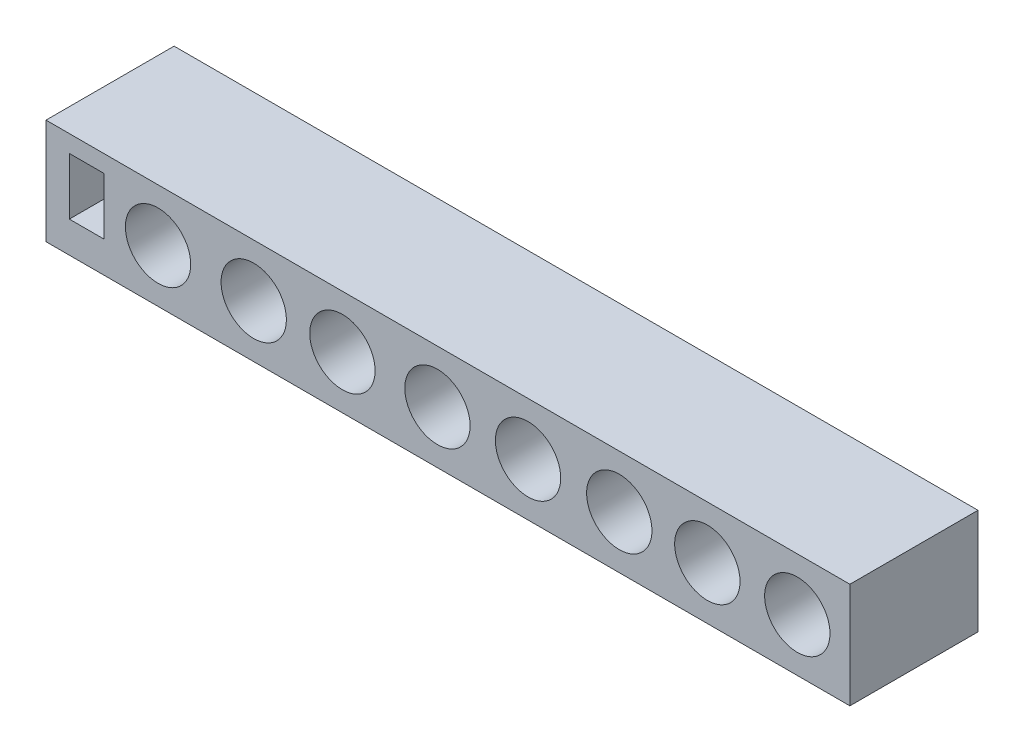
ISO-10303-21;
HEADER;
FILE_DESCRIPTION(('STEP AP214'),'2;1');
FILE_NAME('part.step','',(''),(''),'','','');
FILE_SCHEMA(('AUTOMOTIVE_DESIGN { 1 0 10303 214 1 1 1 1 }'));
ENDSEC;
DATA;
#1=APPLICATION_CONTEXT('core data for automotive mechanical design processes');
#2=APPLICATION_PROTOCOL_DEFINITION('international standard','automotive_design',2000,#1);
#3=PRODUCT_CONTEXT('',#1,'mechanical');
#4=PRODUCT('Part','Part','',(#3));
#5=PRODUCT_RELATED_PRODUCT_CATEGORY('part','',(#4));
#6=PRODUCT_DEFINITION_FORMATION('','',#4);
#7=PRODUCT_DEFINITION_CONTEXT('part definition',#1,'design');
#8=PRODUCT_DEFINITION('design','',#6,#7);
#9=PRODUCT_DEFINITION_SHAPE('','',#8);
#10=(LENGTH_UNIT() NAMED_UNIT(*) SI_UNIT(.MILLI.,.METRE.));
#11=(NAMED_UNIT(*) PLANE_ANGLE_UNIT() SI_UNIT($,.RADIAN.));
#12=(NAMED_UNIT(*) SI_UNIT($,.STERADIAN.) SOLID_ANGLE_UNIT());
#13=UNCERTAINTY_MEASURE_WITH_UNIT(LENGTH_MEASURE(1.E-05),#10,'distance_accuracy_value','');
#14=(GEOMETRIC_REPRESENTATION_CONTEXT(3) GLOBAL_UNCERTAINTY_ASSIGNED_CONTEXT((#13)) GLOBAL_UNIT_ASSIGNED_CONTEXT((#10,
#11,#12)) REPRESENTATION_CONTEXT('',''));
#15=CARTESIAN_POINT('',(0.,0.,0.));
#16=DIRECTION('',(0.,0.,1.));
#17=DIRECTION('',(1.,0.,0.));
#18=AXIS2_PLACEMENT_3D('',#15,#16,#17);
#19=CARTESIAN_POINT('',(0.,0.,10.));
#20=DIRECTION('',(0.,0.,-1.));
#21=DIRECTION('',(-1.,0.,0.));
#22=AXIS2_PLACEMENT_3D('',#19,#20,#21);
#23=PLANE('',#22);
#24=DIRECTION('',(0.,1.,0.));
#25=VECTOR('',#24,1.);
#26=CARTESIAN_POINT('',(0.,0.,10.));
#27=LINE('',#26,#25);
#28=CARTESIAN_POINT('',(0.,0.,10.));
#29=VERTEX_POINT('',#28);
#30=CARTESIAN_POINT('',(0.,8.22292183537418,10.));
#31=VERTEX_POINT('',#30);
#32=EDGE_CURVE('E139',#29,#31,#27,.T.);
#33=ORIENTED_EDGE('',*,*,#32,.F.);
#34=DIRECTION('',(1.,0.,0.));
#35=VECTOR('',#34,1.);
#36=CARTESIAN_POINT('',(0.,0.,10.));
#37=LINE('',#36,#35);
#38=CARTESIAN_POINT('',(62.7555434024689,0.,10.));
#39=VERTEX_POINT('',#38);
#40=EDGE_CURVE('E148',#29,#39,#37,.T.);
#41=ORIENTED_EDGE('',*,*,#40,.T.);
#42=DIRECTION('',(0.,1.,0.));
#43=VECTOR('',#42,1.);
#44=CARTESIAN_POINT('',(62.7555434024689,0.,10.));
#45=LINE('',#44,#43);
#46=CARTESIAN_POINT('',(62.7555434024689,8.22292183537418,10.));
#47=VERTEX_POINT('',#46);
#48=EDGE_CURVE('E146',#39,#47,#45,.T.);
#49=ORIENTED_EDGE('',*,*,#48,.T.);
#50=DIRECTION('',(1.,0.,0.));
#51=VECTOR('',#50,1.);
#52=CARTESIAN_POINT('',(0.,8.22292183537418,10.));
#53=LINE('',#52,#51);
#54=EDGE_CURVE('E142',#31,#47,#53,.T.);
#55=ORIENTED_EDGE('',*,*,#54,.F.);
#56=EDGE_LOOP('',(#33,#41,#49,#55));
#57=FACE_BOUND('',#56,.T.);
#58=DIRECTION('',(0.,-1.,0.));
#59=VECTOR('',#58,1.);
#60=CARTESIAN_POINT('',(1.82224015524807,0.,10.));
#61=LINE('',#60,#59);
#62=CARTESIAN_POINT('',(1.82224015524807,6.8811565198335,10.));
#63=VERTEX_POINT('',#62);
#64=CARTESIAN_POINT('',(1.82224015524807,2.44166175790809,10.));
#65=VERTEX_POINT('',#64);
#66=EDGE_CURVE('E101',#63,#65,#61,.T.);
#67=ORIENTED_EDGE('',*,*,#66,.F.);
#68=DIRECTION('',(-1.,0.,0.));
#69=VECTOR('',#68,1.);
#70=CARTESIAN_POINT('',(0.,6.8811565198335,10.));
#71=LINE('',#70,#69);
#72=CARTESIAN_POINT('',(4.51165222285604,6.8811565198335,10.));
#73=VERTEX_POINT('',#72);
#74=EDGE_CURVE('E123',#73,#63,#71,.T.);
#75=ORIENTED_EDGE('',*,*,#74,.F.);
#76=DIRECTION('',(0.,-1.,0.));
#77=VECTOR('',#76,1.);
#78=CARTESIAN_POINT('',(4.51165222285606,0.,10.));
#79=LINE('',#78,#77);
#80=CARTESIAN_POINT('',(4.51165222285605,2.44166175790809,10.));
#81=VERTEX_POINT('',#80);
#82=EDGE_CURVE('E53',#73,#81,#79,.T.);
#83=ORIENTED_EDGE('',*,*,#82,.T.);
#84=DIRECTION('',(-1.,0.,0.));
#85=VECTOR('',#84,1.);
#86=CARTESIAN_POINT('',(0.,2.44166175790809,10.));
#87=LINE('',#86,#85);
#88=EDGE_CURVE('E110',#81,#65,#87,.T.);
#89=ORIENTED_EDGE('',*,*,#88,.T.);
#90=EDGE_LOOP('',(#67,#75,#83,#89));
#91=FACE_BOUND('',#90,.T.);
#92=CARTESIAN_POINT('',(8.74647916061408,4.11146091768709,10.));
#93=DIRECTION('',(0.,0.,1.));
#94=DIRECTION('',(1.,0.,0.));
#95=AXIS2_PLACEMENT_3D('',#92,#93,#94);
#96=CIRCLE('',#95,2.55);
#97=CARTESIAN_POINT('',(11.2964791606141,4.11146091768709,10.));
#98=VERTEX_POINT('',#97);
#99=EDGE_CURVE('E118',#98,#98,#96,.T.);
#100=ORIENTED_EDGE('',*,*,#99,.F.);
#101=EDGE_LOOP('',(#100));
#102=FACE_BOUND('',#101,.T.);
#103=CARTESIAN_POINT('',(16.2147655164017,4.11146091768709,10.));
#104=DIRECTION('',(0.,0.,1.));
#105=DIRECTION('',(1.,0.,0.));
#106=AXIS2_PLACEMENT_3D('',#103,#104,#105);
#107=CIRCLE('',#106,2.55);
#108=CARTESIAN_POINT('',(18.7647655164017,4.11146091768709,10.));
#109=VERTEX_POINT('',#108);
#110=EDGE_CURVE('E203',#109,#109,#107,.T.);
#111=ORIENTED_EDGE('',*,*,#110,.F.);
#112=EDGE_LOOP('',(#111));
#113=FACE_BOUND('',#112,.T.);
#114=CARTESIAN_POINT('',(23.1390045217677,4.11146091768709,10.));
#115=DIRECTION('',(0.,0.,1.));
#116=DIRECTION('',(1.,0.,0.));
#117=AXIS2_PLACEMENT_3D('',#114,#115,#116);
#118=CIRCLE('',#117,2.55);
#119=CARTESIAN_POINT('',(25.6890045217677,4.11146091768709,10.));
#120=VERTEX_POINT('',#119);
#121=EDGE_CURVE('E205',#120,#120,#118,.T.);
#122=ORIENTED_EDGE('',*,*,#121,.F.);
#123=EDGE_LOOP('',(#122));
#124=FACE_BOUND('',#123,.T.);
#125=CARTESIAN_POINT('',(30.557832027517,4.11146091768709,10.));
#126=DIRECTION('',(0.,0.,1.));
#127=DIRECTION('',(1.,0.,0.));
#128=AXIS2_PLACEMENT_3D('',#125,#126,#127);
#129=CIRCLE('',#128,2.55);
#130=CARTESIAN_POINT('',(33.107832027517,4.11146091768709,10.));
#131=VERTEX_POINT('',#130);
#132=EDGE_CURVE('E210',#131,#131,#129,.T.);
#133=ORIENTED_EDGE('',*,*,#132,.F.);
#134=EDGE_LOOP('',(#133));
#135=FACE_BOUND('',#134,.T.);
#136=CARTESIAN_POINT('',(37.630447582998,4.11146091768709,10.));
#137=DIRECTION('',(0.,0.,1.));
#138=DIRECTION('',(1.,0.,0.));
#139=AXIS2_PLACEMENT_3D('',#136,#137,#138);
#140=CIRCLE('',#139,2.55);
#141=CARTESIAN_POINT('',(40.180447582998,4.11146091768709,10.));
#142=VERTEX_POINT('',#141);
#143=EDGE_CURVE('E213',#142,#142,#140,.T.);
#144=ORIENTED_EDGE('',*,*,#143,.F.);
#145=EDGE_LOOP('',(#144));
#146=FACE_BOUND('',#145,.T.);
#147=CARTESIAN_POINT('',(44.7525219885173,4.11146091768709,10.));
#148=DIRECTION('',(0.,0.,1.));
#149=DIRECTION('',(1.,0.,0.));
#150=AXIS2_PLACEMENT_3D('',#147,#148,#149);
#151=CIRCLE('',#150,2.55);
#152=CARTESIAN_POINT('',(47.3025219885173,4.11146091768709,10.));
#153=VERTEX_POINT('',#152);
#154=EDGE_CURVE('E216',#153,#153,#151,.T.);
#155=ORIENTED_EDGE('',*,*,#154,.F.);
#156=EDGE_LOOP('',(#155));
#157=FACE_BOUND('',#156,.T.);
#158=CARTESIAN_POINT('',(51.627302143845,4.1114609176871,10.));
#159=DIRECTION('',(0.,0.,1.));
#160=DIRECTION('',(1.,0.,0.));
#161=AXIS2_PLACEMENT_3D('',#158,#159,#160);
#162=CIRCLE('',#161,2.55);
#163=CARTESIAN_POINT('',(54.177302143845,4.1114609176871,10.));
#164=VERTEX_POINT('',#163);
#165=EDGE_CURVE('E219',#164,#164,#162,.T.);
#166=ORIENTED_EDGE('',*,*,#165,.F.);
#167=EDGE_LOOP('',(#166));
#168=FACE_BOUND('',#167,.T.);
#169=CARTESIAN_POINT('',(58.6504588492877,4.1114609176871,10.));
#170=DIRECTION('',(0.,0.,1.));
#171=DIRECTION('',(1.,0.,0.));
#172=AXIS2_PLACEMENT_3D('',#169,#170,#171);
#173=CIRCLE('',#172,2.55);
#174=CARTESIAN_POINT('',(61.2004588492877,4.1114609176871,10.));
#175=VERTEX_POINT('',#174);
#176=EDGE_CURVE('E155',#175,#175,#173,.T.);
#177=ORIENTED_EDGE('',*,*,#176,.F.);
#178=EDGE_LOOP('',(#177));
#179=FACE_BOUND('',#178,.T.);
#180=ADVANCED_FACE('F36',(#57,#91,#102,#113,#124,#135,#146,#157,#168,#179),#23,.F.);
#181=CARTESIAN_POINT('',(0.,0.,0.));
#182=DIRECTION('',(0.,0.,-1.));
#183=DIRECTION('',(-1.,0.,0.));
#184=AXIS2_PLACEMENT_3D('',#181,#182,#183);
#185=PLANE('',#184);
#186=CARTESIAN_POINT('',(58.6504588492877,4.1114609176871,0.));
#187=DIRECTION('',(0.,0.,1.));
#188=DIRECTION('',(1.,0.,0.));
#189=AXIS2_PLACEMENT_3D('',#186,#187,#188);
#190=CIRCLE('',#189,2.90000000000001);
#191=CARTESIAN_POINT('',(61.5504588492877,4.1114609176871,0.));
#192=VERTEX_POINT('',#191);
#193=EDGE_CURVE('E266',#192,#192,#190,.T.);
#194=ORIENTED_EDGE('',*,*,#193,.T.);
#195=EDGE_LOOP('',(#194));
#196=FACE_BOUND('',#195,.T.);
#197=CARTESIAN_POINT('',(51.627302143845,4.1114609176871,0.));
#198=DIRECTION('',(0.,0.,1.));
#199=DIRECTION('',(1.,0.,0.));
#200=AXIS2_PLACEMENT_3D('',#197,#198,#199);
#201=CIRCLE('',#200,2.875);
#202=CARTESIAN_POINT('',(54.502302143845,4.1114609176871,0.));
#203=VERTEX_POINT('',#202);
#204=EDGE_CURVE('E263',#203,#203,#201,.T.);
#205=ORIENTED_EDGE('',*,*,#204,.T.);
#206=EDGE_LOOP('',(#205));
#207=FACE_BOUND('',#206,.T.);
#208=CARTESIAN_POINT('',(44.7525219885173,4.11146091768709,0.));
#209=DIRECTION('',(0.,0.,1.));
#210=DIRECTION('',(1.,0.,0.));
#211=AXIS2_PLACEMENT_3D('',#208,#209,#210);
#212=CIRCLE('',#211,2.85);
#213=CARTESIAN_POINT('',(47.6025219885173,4.11146091768709,0.));
#214=VERTEX_POINT('',#213);
#215=EDGE_CURVE('E257',#214,#214,#212,.T.);
#216=ORIENTED_EDGE('',*,*,#215,.T.);
#217=EDGE_LOOP('',(#216));
#218=FACE_BOUND('',#217,.T.);
#219=CARTESIAN_POINT('',(37.630447582998,4.11146091768709,0.));
#220=DIRECTION('',(0.,0.,1.));
#221=DIRECTION('',(1.,0.,0.));
#222=AXIS2_PLACEMENT_3D('',#219,#220,#221);
#223=CIRCLE('',#222,2.825);
#224=CARTESIAN_POINT('',(40.455447582998,4.11146091768709,0.));
#225=VERTEX_POINT('',#224);
#226=EDGE_CURVE('E251',#225,#225,#223,.T.);
#227=ORIENTED_EDGE('',*,*,#226,.T.);
#228=EDGE_LOOP('',(#227));
#229=FACE_BOUND('',#228,.T.);
#230=CARTESIAN_POINT('',(30.557832027517,4.11146091768709,0.));
#231=DIRECTION('',(0.,0.,1.));
#232=DIRECTION('',(1.,0.,0.));
#233=AXIS2_PLACEMENT_3D('',#230,#231,#232);
#234=CIRCLE('',#233,2.725);
#235=CARTESIAN_POINT('',(33.282832027517,4.11146091768709,0.));
#236=VERTEX_POINT('',#235);
#237=EDGE_CURVE('E245',#236,#236,#234,.T.);
#238=ORIENTED_EDGE('',*,*,#237,.T.);
#239=EDGE_LOOP('',(#238));
#240=FACE_BOUND('',#239,.T.);
#241=CARTESIAN_POINT('',(23.1390045217677,4.11146091768709,0.));
#242=DIRECTION('',(0.,0.,1.));
#243=DIRECTION('',(1.,0.,0.));
#244=AXIS2_PLACEMENT_3D('',#241,#242,#243);
#245=CIRCLE('',#244,2.75);
#246=CARTESIAN_POINT('',(25.8890045217677,4.11146091768709,0.));
#247=VERTEX_POINT('',#246);
#248=EDGE_CURVE('E239',#247,#247,#245,.T.);
#249=ORIENTED_EDGE('',*,*,#248,.T.);
#250=EDGE_LOOP('',(#249));
#251=FACE_BOUND('',#250,.T.);
#252=CARTESIAN_POINT('',(16.2147655164017,4.11146091768709,0.));
#253=DIRECTION('',(0.,0.,1.));
#254=DIRECTION('',(1.,0.,0.));
#255=AXIS2_PLACEMENT_3D('',#252,#253,#254);
#256=CIRCLE('',#255,2.775);
#257=CARTESIAN_POINT('',(18.9897655164017,4.11146091768709,0.));
#258=VERTEX_POINT('',#257);
#259=EDGE_CURVE('E233',#258,#258,#256,.T.);
#260=ORIENTED_EDGE('',*,*,#259,.T.);
#261=EDGE_LOOP('',(#260));
#262=FACE_BOUND('',#261,.T.);
#263=CARTESIAN_POINT('',(8.74647916061408,4.11146091768709,0.));
#264=DIRECTION('',(0.,0.,1.));
#265=DIRECTION('',(1.,0.,0.));
#266=AXIS2_PLACEMENT_3D('',#263,#264,#265);
#267=CIRCLE('',#266,2.8);
#268=CARTESIAN_POINT('',(11.5464791606141,4.11146091768709,0.));
#269=VERTEX_POINT('',#268);
#270=EDGE_CURVE('E227',#269,#269,#267,.T.);
#271=ORIENTED_EDGE('',*,*,#270,.T.);
#272=EDGE_LOOP('',(#271));
#273=FACE_BOUND('',#272,.T.);
#274=DIRECTION('',(0.,1.,0.));
#275=VECTOR('',#274,1.);
#276=CARTESIAN_POINT('',(0.,0.,0.));
#277=LINE('',#276,#275);
#278=CARTESIAN_POINT('',(0.,0.,0.));
#279=VERTEX_POINT('',#278);
#280=CARTESIAN_POINT('',(0.,8.22292183537418,0.));
#281=VERTEX_POINT('',#280);
#282=EDGE_CURVE('E151',#279,#281,#277,.T.);
#283=ORIENTED_EDGE('',*,*,#282,.T.);
#284=DIRECTION('',(1.,0.,0.));
#285=VECTOR('',#284,1.);
#286=CARTESIAN_POINT('',(0.,8.22292183537418,0.));
#287=LINE('',#286,#285);
#288=CARTESIAN_POINT('',(62.7555434024689,8.22292183537418,0.));
#289=VERTEX_POINT('',#288);
#290=EDGE_CURVE('E154',#281,#289,#287,.T.);
#291=ORIENTED_EDGE('',*,*,#290,.T.);
#292=DIRECTION('',(0.,1.,0.));
#293=VECTOR('',#292,1.);
#294=CARTESIAN_POINT('',(62.7555434024689,0.,0.));
#295=LINE('',#294,#293);
#296=CARTESIAN_POINT('',(62.7555434024689,0.,0.));
#297=VERTEX_POINT('',#296);
#298=EDGE_CURVE('E158',#297,#289,#295,.T.);
#299=ORIENTED_EDGE('',*,*,#298,.F.);
#300=DIRECTION('',(1.,0.,0.));
#301=VECTOR('',#300,1.);
#302=CARTESIAN_POINT('',(0.,0.,0.));
#303=LINE('',#302,#301);
#304=EDGE_CURVE('E143',#279,#297,#303,.T.);
#305=ORIENTED_EDGE('',*,*,#304,.F.);
#306=EDGE_LOOP('',(#283,#291,#299,#305));
#307=FACE_BOUND('',#306,.T.);
#308=DIRECTION('',(-1.,0.,0.));
#309=VECTOR('',#308,1.);
#310=CARTESIAN_POINT('',(0.,6.8811565198335,0.));
#311=LINE('',#310,#309);
#312=CARTESIAN_POINT('',(4.51165222285604,6.8811565198335,0.));
#313=VERTEX_POINT('',#312);
#314=CARTESIAN_POINT('',(1.82224015524807,6.8811565198335,0.));
#315=VERTEX_POINT('',#314);
#316=EDGE_CURVE('E111',#313,#315,#311,.T.);
#317=ORIENTED_EDGE('',*,*,#316,.T.);
#318=DIRECTION('',(0.,-1.,0.));
#319=VECTOR('',#318,1.);
#320=CARTESIAN_POINT('',(1.82224015524807,0.,0.));
#321=LINE('',#320,#319);
#322=CARTESIAN_POINT('',(1.82224015524807,2.44166175790809,0.));
#323=VERTEX_POINT('',#322);
#324=EDGE_CURVE('E61',#315,#323,#321,.T.);
#325=ORIENTED_EDGE('',*,*,#324,.T.);
#326=DIRECTION('',(-1.,0.,0.));
#327=VECTOR('',#326,1.);
#328=CARTESIAN_POINT('',(0.,2.44166175790809,0.));
#329=LINE('',#328,#327);
#330=CARTESIAN_POINT('',(4.51165222285605,2.44166175790809,0.));
#331=VERTEX_POINT('',#330);
#332=EDGE_CURVE('E117',#331,#323,#329,.T.);
#333=ORIENTED_EDGE('',*,*,#332,.F.);
#334=DIRECTION('',(0.,-1.,0.));
#335=VECTOR('',#334,1.);
#336=CARTESIAN_POINT('',(4.51165222285606,0.,0.));
#337=LINE('',#336,#335);
#338=EDGE_CURVE('E130',#313,#331,#337,.T.);
#339=ORIENTED_EDGE('',*,*,#338,.F.);
#340=EDGE_LOOP('',(#317,#325,#333,#339));
#341=FACE_BOUND('',#340,.T.);
#342=ADVANCED_FACE('F290',(#196,#207,#218,#229,#240,#251,#262,#273,#307,#341),#185,.T.);
#343=CARTESIAN_POINT('',(0.,0.,10.));
#344=DIRECTION('',(-1.,0.,0.));
#345=DIRECTION('',(0.,0.,1.));
#346=AXIS2_PLACEMENT_3D('',#343,#344,#345);
#347=PLANE('',#346);
#348=ORIENTED_EDGE('',*,*,#282,.F.);
#349=DIRECTION('',(0.,0.,-1.));
#350=VECTOR('',#349,1.);
#351=CARTESIAN_POINT('',(0.,0.,10.));
#352=LINE('',#351,#350);
#353=EDGE_CURVE('E11',#29,#279,#352,.T.);
#354=ORIENTED_EDGE('',*,*,#353,.F.);
#355=ORIENTED_EDGE('',*,*,#32,.T.);
#356=DIRECTION('',(0.,0.,-1.));
#357=VECTOR('',#356,1.);
#358=CARTESIAN_POINT('',(0.,8.22292183537418,10.));
#359=LINE('',#358,#357);
#360=EDGE_CURVE('E150',#31,#281,#359,.T.);
#361=ORIENTED_EDGE('',*,*,#360,.T.);
#362=EDGE_LOOP('',(#348,#354,#355,#361));
#363=FACE_BOUND('',#362,.T.);
#364=ADVANCED_FACE('F38',(#363),#347,.T.);
#365=CARTESIAN_POINT('',(0.,0.,10.));
#366=DIRECTION('',(0.,1.,0.));
#367=DIRECTION('',(0.,0.,1.));
#368=AXIS2_PLACEMENT_3D('',#365,#366,#367);
#369=PLANE('',#368);
#370=ORIENTED_EDGE('',*,*,#304,.T.);
#371=DIRECTION('',(0.,0.,-1.));
#372=VECTOR('',#371,1.);
#373=CARTESIAN_POINT('',(62.7555434024689,0.,10.));
#374=LINE('',#373,#372);
#375=EDGE_CURVE('E45',#39,#297,#374,.T.);
#376=ORIENTED_EDGE('',*,*,#375,.F.);
#377=ORIENTED_EDGE('',*,*,#40,.F.);
#378=ORIENTED_EDGE('',*,*,#353,.T.);
#379=EDGE_LOOP('',(#370,#376,#377,#378));
#380=FACE_BOUND('',#379,.T.);
#381=ADVANCED_FACE('F302',(#380),#369,.F.);
#382=CARTESIAN_POINT('',(62.7555434024689,0.,10.));
#383=DIRECTION('',(-1.,0.,0.));
#384=DIRECTION('',(0.,0.,1.));
#385=AXIS2_PLACEMENT_3D('',#382,#383,#384);
#386=PLANE('',#385);
#387=ORIENTED_EDGE('',*,*,#298,.T.);
#388=DIRECTION('',(0.,0.,-1.));
#389=VECTOR('',#388,1.);
#390=CARTESIAN_POINT('',(62.7555434024689,8.22292183537418,10.));
#391=LINE('',#390,#389);
#392=EDGE_CURVE('E164',#47,#289,#391,.T.);
#393=ORIENTED_EDGE('',*,*,#392,.F.);
#394=ORIENTED_EDGE('',*,*,#48,.F.);
#395=ORIENTED_EDGE('',*,*,#375,.T.);
#396=EDGE_LOOP('',(#387,#393,#394,#395));
#397=FACE_BOUND('',#396,.T.);
#398=ADVANCED_FACE('F305',(#397),#386,.F.);
#399=CARTESIAN_POINT('',(0.,8.22292183537418,10.));
#400=DIRECTION('',(0.,1.,0.));
#401=DIRECTION('',(0.,0.,1.));
#402=AXIS2_PLACEMENT_3D('',#399,#400,#401);
#403=PLANE('',#402);
#404=ORIENTED_EDGE('',*,*,#290,.F.);
#405=ORIENTED_EDGE('',*,*,#360,.F.);
#406=ORIENTED_EDGE('',*,*,#54,.T.);
#407=ORIENTED_EDGE('',*,*,#392,.T.);
#408=EDGE_LOOP('',(#404,#405,#406,#407));
#409=FACE_BOUND('',#408,.T.);
#410=ADVANCED_FACE('F308',(#409),#403,.T.);
#411=CARTESIAN_POINT('',(1.82224015524807,0.,10.));
#412=DIRECTION('',(1.,0.,0.));
#413=DIRECTION('',(0.,1.,0.));
#414=AXIS2_PLACEMENT_3D('',#411,#412,#413);
#415=PLANE('',#414);
#416=ORIENTED_EDGE('',*,*,#324,.F.);
#417=DIRECTION('',(0.,0.,-1.));
#418=VECTOR('',#417,1.);
#419=CARTESIAN_POINT('',(1.82224015524807,6.8811565198335,10.));
#420=LINE('',#419,#418);
#421=EDGE_CURVE('E106',#63,#315,#420,.T.);
#422=ORIENTED_EDGE('',*,*,#421,.F.);
#423=ORIENTED_EDGE('',*,*,#66,.T.);
#424=DIRECTION('',(0.,0.,-1.));
#425=VECTOR('',#424,1.);
#426=CARTESIAN_POINT('',(1.82224015524807,2.44166175790809,10.));
#427=LINE('',#426,#425);
#428=EDGE_CURVE('E104',#65,#323,#427,.T.);
#429=ORIENTED_EDGE('',*,*,#428,.T.);
#430=EDGE_LOOP('',(#416,#422,#423,#429));
#431=FACE_BOUND('',#430,.T.);
#432=ADVANCED_FACE('F103',(#431),#415,.T.);
#433=CARTESIAN_POINT('',(0.,2.44166175790809,10.));
#434=DIRECTION('',(0.,-1.,0.));
#435=DIRECTION('',(1.,0.,0.));
#436=AXIS2_PLACEMENT_3D('',#433,#434,#435);
#437=PLANE('',#436);
#438=ORIENTED_EDGE('',*,*,#332,.T.);
#439=ORIENTED_EDGE('',*,*,#428,.F.);
#440=ORIENTED_EDGE('',*,*,#88,.F.);
#441=DIRECTION('',(0.,0.,-1.));
#442=VECTOR('',#441,1.);
#443=CARTESIAN_POINT('',(4.51165222285605,2.44166175790809,10.));
#444=LINE('',#443,#442);
#445=EDGE_CURVE('E119',#81,#331,#444,.T.);
#446=ORIENTED_EDGE('',*,*,#445,.T.);
#447=EDGE_LOOP('',(#438,#439,#440,#446));
#448=FACE_BOUND('',#447,.T.);
#449=ADVANCED_FACE('F115',(#448),#437,.F.);
#450=CARTESIAN_POINT('',(4.51165222285606,0.,10.));
#451=DIRECTION('',(1.,0.,0.));
#452=DIRECTION('',(0.,1.,0.));
#453=AXIS2_PLACEMENT_3D('',#450,#451,#452);
#454=PLANE('',#453);
#455=ORIENTED_EDGE('',*,*,#338,.T.);
#456=ORIENTED_EDGE('',*,*,#445,.F.);
#457=ORIENTED_EDGE('',*,*,#82,.F.);
#458=DIRECTION('',(0.,0.,-1.));
#459=VECTOR('',#458,1.);
#460=CARTESIAN_POINT('',(4.51165222285604,6.8811565198335,10.));
#461=LINE('',#460,#459);
#462=EDGE_CURVE('E136',#73,#313,#461,.T.);
#463=ORIENTED_EDGE('',*,*,#462,.T.);
#464=EDGE_LOOP('',(#455,#456,#457,#463));
#465=FACE_BOUND('',#464,.T.);
#466=ADVANCED_FACE('F364',(#465),#454,.F.);
#467=CARTESIAN_POINT('',(0.,6.8811565198335,10.));
#468=DIRECTION('',(0.,-1.,0.));
#469=DIRECTION('',(0.,0.,-1.));
#470=AXIS2_PLACEMENT_3D('',#467,#468,#469);
#471=PLANE('',#470);
#472=ORIENTED_EDGE('',*,*,#316,.F.);
#473=ORIENTED_EDGE('',*,*,#462,.F.);
#474=ORIENTED_EDGE('',*,*,#74,.T.);
#475=ORIENTED_EDGE('',*,*,#421,.T.);
#476=EDGE_LOOP('',(#472,#473,#474,#475));
#477=FACE_BOUND('',#476,.T.);
#478=ADVANCED_FACE('F199',(#477),#471,.T.);
#479=CARTESIAN_POINT('',(8.74647916061408,4.11146091768709,10.));
#480=DIRECTION('',(0.,0.,-1.));
#481=DIRECTION('',(-1.,0.,0.));
#482=AXIS2_PLACEMENT_3D('',#479,#480,#481);
#483=CYLINDRICAL_SURFACE('',#482,2.55);
#484=CARTESIAN_POINT('',(8.74647916061408,4.11146091768709,1.2));
#485=DIRECTION('',(0.,0.,1.));
#486=DIRECTION('',(1.,0.,0.));
#487=AXIS2_PLACEMENT_3D('',#484,#485,#486);
#488=CIRCLE('',#487,2.55);
#489=CARTESIAN_POINT('',(11.2964791606141,4.11146091768709,1.2));
#490=VERTEX_POINT('',#489);
#491=EDGE_CURVE('E40',#490,#490,#488,.T.);
#492=ORIENTED_EDGE('',*,*,#491,.F.);
#493=EDGE_LOOP('',(#492));
#494=FACE_BOUND('',#493,.T.);
#495=ORIENTED_EDGE('',*,*,#99,.T.);
#496=EDGE_LOOP('',(#495));
#497=FACE_BOUND('',#496,.T.);
#498=ADVANCED_FACE('F195',(#494,#497),#483,.F.);
#499=CARTESIAN_POINT('',(16.2147655164017,4.11146091768709,10.));
#500=DIRECTION('',(0.,0.,-1.));
#501=DIRECTION('',(-1.,0.,0.));
#502=AXIS2_PLACEMENT_3D('',#499,#500,#501);
#503=CYLINDRICAL_SURFACE('',#502,2.55);
#504=CARTESIAN_POINT('',(16.2147655164017,4.11146091768709,1.2));
#505=DIRECTION('',(0.,0.,1.));
#506=DIRECTION('',(1.,0.,0.));
#507=AXIS2_PLACEMENT_3D('',#504,#505,#506);
#508=CIRCLE('',#507,2.55);
#509=CARTESIAN_POINT('',(18.7647655164017,4.11146091768709,1.2));
#510=VERTEX_POINT('',#509);
#511=EDGE_CURVE('E185',#510,#510,#508,.T.);
#512=ORIENTED_EDGE('',*,*,#511,.F.);
#513=EDGE_LOOP('',(#512));
#514=FACE_BOUND('',#513,.T.);
#515=ORIENTED_EDGE('',*,*,#110,.T.);
#516=EDGE_LOOP('',(#515));
#517=FACE_BOUND('',#516,.T.);
#518=ADVANCED_FACE('F198',(#514,#517),#503,.F.);
#519=CARTESIAN_POINT('',(23.1390045217677,4.11146091768709,10.));
#520=DIRECTION('',(0.,0.,-1.));
#521=DIRECTION('',(-1.,0.,0.));
#522=AXIS2_PLACEMENT_3D('',#519,#520,#521);
#523=CYLINDRICAL_SURFACE('',#522,2.55);
#524=CARTESIAN_POINT('',(23.1390045217677,4.11146091768709,1.2));
#525=DIRECTION('',(0.,0.,1.));
#526=DIRECTION('',(1.,0.,0.));
#527=AXIS2_PLACEMENT_3D('',#524,#525,#526);
#528=CIRCLE('',#527,2.55);
#529=CARTESIAN_POINT('',(25.6890045217677,4.11146091768709,1.2));
#530=VERTEX_POINT('',#529);
#531=EDGE_CURVE('E183',#530,#530,#528,.T.);
#532=ORIENTED_EDGE('',*,*,#531,.F.);
#533=EDGE_LOOP('',(#532));
#534=FACE_BOUND('',#533,.T.);
#535=ORIENTED_EDGE('',*,*,#121,.T.);
#536=EDGE_LOOP('',(#535));
#537=FACE_BOUND('',#536,.T.);
#538=ADVANCED_FACE('F398',(#534,#537),#523,.F.);
#539=CARTESIAN_POINT('',(30.557832027517,4.11146091768709,10.));
#540=DIRECTION('',(0.,0.,-1.));
#541=DIRECTION('',(-1.,0.,0.));
#542=AXIS2_PLACEMENT_3D('',#539,#540,#541);
#543=CYLINDRICAL_SURFACE('',#542,2.55);
#544=CARTESIAN_POINT('',(30.557832027517,4.11146091768709,1.2));
#545=DIRECTION('',(0.,0.,1.));
#546=DIRECTION('',(1.,0.,0.));
#547=AXIS2_PLACEMENT_3D('',#544,#545,#546);
#548=CIRCLE('',#547,2.55);
#549=CARTESIAN_POINT('',(33.107832027517,4.11146091768709,1.2));
#550=VERTEX_POINT('',#549);
#551=EDGE_CURVE('E180',#550,#550,#548,.T.);
#552=ORIENTED_EDGE('',*,*,#551,.F.);
#553=EDGE_LOOP('',(#552));
#554=FACE_BOUND('',#553,.T.);
#555=ORIENTED_EDGE('',*,*,#132,.T.);
#556=EDGE_LOOP('',(#555));
#557=FACE_BOUND('',#556,.T.);
#558=ADVANCED_FACE('F408',(#554,#557),#543,.F.);
#559=CARTESIAN_POINT('',(37.630447582998,4.11146091768709,10.));
#560=DIRECTION('',(0.,0.,-1.));
#561=DIRECTION('',(-1.,0.,0.));
#562=AXIS2_PLACEMENT_3D('',#559,#560,#561);
#563=CYLINDRICAL_SURFACE('',#562,2.55);
#564=CARTESIAN_POINT('',(37.630447582998,4.11146091768709,1.2));
#565=DIRECTION('',(0.,0.,1.));
#566=DIRECTION('',(1.,0.,0.));
#567=AXIS2_PLACEMENT_3D('',#564,#565,#566);
#568=CIRCLE('',#567,2.55);
#569=CARTESIAN_POINT('',(40.180447582998,4.11146091768709,1.2));
#570=VERTEX_POINT('',#569);
#571=EDGE_CURVE('E177',#570,#570,#568,.T.);
#572=ORIENTED_EDGE('',*,*,#571,.F.);
#573=EDGE_LOOP('',(#572));
#574=FACE_BOUND('',#573,.T.);
#575=ORIENTED_EDGE('',*,*,#143,.T.);
#576=EDGE_LOOP('',(#575));
#577=FACE_BOUND('',#576,.T.);
#578=ADVANCED_FACE('F418',(#574,#577),#563,.F.);
#579=CARTESIAN_POINT('',(44.7525219885173,4.11146091768709,10.));
#580=DIRECTION('',(0.,0.,-1.));
#581=DIRECTION('',(-1.,0.,0.));
#582=AXIS2_PLACEMENT_3D('',#579,#580,#581);
#583=CYLINDRICAL_SURFACE('',#582,2.55);
#584=CARTESIAN_POINT('',(44.7525219885173,4.11146091768709,1.2));
#585=DIRECTION('',(0.,0.,1.));
#586=DIRECTION('',(1.,0.,0.));
#587=AXIS2_PLACEMENT_3D('',#584,#585,#586);
#588=CIRCLE('',#587,2.55);
#589=CARTESIAN_POINT('',(47.3025219885173,4.11146091768709,1.2));
#590=VERTEX_POINT('',#589);
#591=EDGE_CURVE('E174',#590,#590,#588,.T.);
#592=ORIENTED_EDGE('',*,*,#591,.F.);
#593=EDGE_LOOP('',(#592));
#594=FACE_BOUND('',#593,.T.);
#595=ORIENTED_EDGE('',*,*,#154,.T.);
#596=EDGE_LOOP('',(#595));
#597=FACE_BOUND('',#596,.T.);
#598=ADVANCED_FACE('F428',(#594,#597),#583,.F.);
#599=CARTESIAN_POINT('',(51.627302143845,4.1114609176871,10.));
#600=DIRECTION('',(0.,0.,-1.));
#601=DIRECTION('',(-1.,0.,0.));
#602=AXIS2_PLACEMENT_3D('',#599,#600,#601);
#603=CYLINDRICAL_SURFACE('',#602,2.55);
#604=CARTESIAN_POINT('',(51.627302143845,4.1114609176871,1.2));
#605=DIRECTION('',(0.,0.,1.));
#606=DIRECTION('',(1.,0.,0.));
#607=AXIS2_PLACEMENT_3D('',#604,#605,#606);
#608=CIRCLE('',#607,2.55);
#609=CARTESIAN_POINT('',(54.177302143845,4.1114609176871,1.2));
#610=VERTEX_POINT('',#609);
#611=EDGE_CURVE('E170',#610,#610,#608,.T.);
#612=ORIENTED_EDGE('',*,*,#611,.F.);
#613=EDGE_LOOP('',(#612));
#614=FACE_BOUND('',#613,.T.);
#615=ORIENTED_EDGE('',*,*,#165,.T.);
#616=EDGE_LOOP('',(#615));
#617=FACE_BOUND('',#616,.T.);
#618=ADVANCED_FACE('F438',(#614,#617),#603,.F.);
#619=CARTESIAN_POINT('',(58.6504588492877,4.1114609176871,10.));
#620=DIRECTION('',(0.,0.,-1.));
#621=DIRECTION('',(-1.,0.,0.));
#622=AXIS2_PLACEMENT_3D('',#619,#620,#621);
#623=CYLINDRICAL_SURFACE('',#622,2.55);
#624=CARTESIAN_POINT('',(58.6504588492877,4.1114609176871,1.2));
#625=DIRECTION('',(0.,0.,1.));
#626=DIRECTION('',(1.,0.,0.));
#627=AXIS2_PLACEMENT_3D('',#624,#625,#626);
#628=CIRCLE('',#627,2.55);
#629=CARTESIAN_POINT('',(61.2004588492877,4.1114609176871,1.2));
#630=VERTEX_POINT('',#629);
#631=EDGE_CURVE('E167',#630,#630,#628,.T.);
#632=ORIENTED_EDGE('',*,*,#631,.F.);
#633=EDGE_LOOP('',(#632));
#634=FACE_BOUND('',#633,.T.);
#635=ORIENTED_EDGE('',*,*,#176,.T.);
#636=EDGE_LOOP('',(#635));
#637=FACE_BOUND('',#636,.T.);
#638=ADVANCED_FACE('F287',(#634,#637),#623,.F.);
#639=CARTESIAN_POINT('',(58.6504588492877,4.1114609176871,1.2));
#640=DIRECTION('',(0.,0.,-1.));
#641=DIRECTION('',(-1.,0.,0.));
#642=AXIS2_PLACEMENT_3D('',#639,#640,#641);
#643=CYLINDRICAL_SURFACE('',#642,2.90000000000001);
#644=CARTESIAN_POINT('',(58.6504588492877,4.1114609176871,1.2));
#645=DIRECTION('',(0.,0.,1.));
#646=DIRECTION('',(1.,0.,0.));
#647=AXIS2_PLACEMENT_3D('',#644,#645,#646);
#648=CIRCLE('',#647,2.90000000000001);
#649=CARTESIAN_POINT('',(61.5504588492877,4.1114609176871,1.2));
#650=VERTEX_POINT('',#649);
#651=EDGE_CURVE('E171',#650,#650,#648,.T.);
#652=ORIENTED_EDGE('',*,*,#651,.T.);
#653=EDGE_LOOP('',(#652));
#654=FACE_BOUND('',#653,.T.);
#655=ORIENTED_EDGE('',*,*,#193,.F.);
#656=EDGE_LOOP('',(#655));
#657=FACE_BOUND('',#656,.T.);
#658=ADVANCED_FACE('F272',(#654,#657),#643,.F.);
#659=CARTESIAN_POINT('',(58.6504588492877,4.1114609176871,1.2));
#660=DIRECTION('',(0.,0.,1.));
#661=DIRECTION('',(1.,0.,0.));
#662=AXIS2_PLACEMENT_3D('',#659,#660,#661);
#663=PLANE('',#662);
#664=ORIENTED_EDGE('',*,*,#631,.T.);
#665=EDGE_LOOP('',(#664));
#666=FACE_BOUND('',#665,.T.);
#667=ORIENTED_EDGE('',*,*,#651,.F.);
#668=EDGE_LOOP('',(#667));
#669=FACE_BOUND('',#668,.T.);
#670=ADVANCED_FACE('F275',(#666,#669),#663,.F.);
#671=CARTESIAN_POINT('',(51.627302143845,4.1114609176871,1.2));
#672=DIRECTION('',(0.,0.,-1.));
#673=DIRECTION('',(-1.,0.,0.));
#674=AXIS2_PLACEMENT_3D('',#671,#672,#673);
#675=CYLINDRICAL_SURFACE('',#674,2.875);
#676=CARTESIAN_POINT('',(51.627302143845,4.1114609176871,1.2));
#677=DIRECTION('',(0.,0.,1.));
#678=DIRECTION('',(1.,0.,0.));
#679=AXIS2_PLACEMENT_3D('',#676,#677,#678);
#680=CIRCLE('',#679,2.875);
#681=CARTESIAN_POINT('',(54.502302143845,4.1114609176871,1.2));
#682=VERTEX_POINT('',#681);
#683=EDGE_CURVE('E260',#682,#682,#680,.T.);
#684=ORIENTED_EDGE('',*,*,#683,.T.);
#685=EDGE_LOOP('',(#684));
#686=FACE_BOUND('',#685,.T.);
#687=ORIENTED_EDGE('',*,*,#204,.F.);
#688=EDGE_LOOP('',(#687));
#689=FACE_BOUND('',#688,.T.);
#690=ADVANCED_FACE('F277',(#686,#689),#675,.F.);
#691=CARTESIAN_POINT('',(51.627302143845,4.1114609176871,1.2));
#692=DIRECTION('',(0.,0.,1.));
#693=DIRECTION('',(1.,0.,0.));
#694=AXIS2_PLACEMENT_3D('',#691,#692,#693);
#695=PLANE('',#694);
#696=ORIENTED_EDGE('',*,*,#611,.T.);
#697=EDGE_LOOP('',(#696));
#698=FACE_BOUND('',#697,.T.);
#699=ORIENTED_EDGE('',*,*,#683,.F.);
#700=EDGE_LOOP('',(#699));
#701=FACE_BOUND('',#700,.T.);
#702=ADVANCED_FACE('F284',(#698,#701),#695,.F.);
#703=CARTESIAN_POINT('',(44.7525219885173,4.11146091768709,1.2));
#704=DIRECTION('',(0.,0.,-1.));
#705=DIRECTION('',(-1.,0.,0.));
#706=AXIS2_PLACEMENT_3D('',#703,#704,#705);
#707=CYLINDRICAL_SURFACE('',#706,2.85);
#708=CARTESIAN_POINT('',(44.7525219885173,4.11146091768709,1.2));
#709=DIRECTION('',(0.,0.,1.));
#710=DIRECTION('',(1.,0.,0.));
#711=AXIS2_PLACEMENT_3D('',#708,#709,#710);
#712=CIRCLE('',#711,2.85);
#713=CARTESIAN_POINT('',(47.6025219885173,4.11146091768709,1.2));
#714=VERTEX_POINT('',#713);
#715=EDGE_CURVE('E254',#714,#714,#712,.T.);
#716=ORIENTED_EDGE('',*,*,#715,.T.);
#717=EDGE_LOOP('',(#716));
#718=FACE_BOUND('',#717,.T.);
#719=ORIENTED_EDGE('',*,*,#215,.F.);
#720=EDGE_LOOP('',(#719));
#721=FACE_BOUND('',#720,.T.);
#722=ADVANCED_FACE('F482',(#718,#721),#707,.F.);
#723=CARTESIAN_POINT('',(44.7525219885173,4.11146091768709,1.2));
#724=DIRECTION('',(0.,0.,1.));
#725=DIRECTION('',(1.,0.,0.));
#726=AXIS2_PLACEMENT_3D('',#723,#724,#725);
#727=PLANE('',#726);
#728=ORIENTED_EDGE('',*,*,#591,.T.);
#729=EDGE_LOOP('',(#728));
#730=FACE_BOUND('',#729,.T.);
#731=ORIENTED_EDGE('',*,*,#715,.F.);
#732=EDGE_LOOP('',(#731));
#733=FACE_BOUND('',#732,.T.);
#734=ADVANCED_FACE('F492',(#730,#733),#727,.F.);
#735=CARTESIAN_POINT('',(37.630447582998,4.11146091768709,1.2));
#736=DIRECTION('',(0.,0.,-1.));
#737=DIRECTION('',(-1.,0.,0.));
#738=AXIS2_PLACEMENT_3D('',#735,#736,#737);
#739=CYLINDRICAL_SURFACE('',#738,2.825);
#740=CARTESIAN_POINT('',(37.630447582998,4.11146091768709,1.2));
#741=DIRECTION('',(0.,0.,1.));
#742=DIRECTION('',(1.,0.,0.));
#743=AXIS2_PLACEMENT_3D('',#740,#741,#742);
#744=CIRCLE('',#743,2.825);
#745=CARTESIAN_POINT('',(40.455447582998,4.11146091768709,1.2));
#746=VERTEX_POINT('',#745);
#747=EDGE_CURVE('E248',#746,#746,#744,.T.);
#748=ORIENTED_EDGE('',*,*,#747,.T.);
#749=EDGE_LOOP('',(#748));
#750=FACE_BOUND('',#749,.T.);
#751=ORIENTED_EDGE('',*,*,#226,.F.);
#752=EDGE_LOOP('',(#751));
#753=FACE_BOUND('',#752,.T.);
#754=ADVANCED_FACE('F502',(#750,#753),#739,.F.);
#755=CARTESIAN_POINT('',(37.630447582998,4.11146091768709,1.2));
#756=DIRECTION('',(0.,0.,1.));
#757=DIRECTION('',(1.,0.,0.));
#758=AXIS2_PLACEMENT_3D('',#755,#756,#757);
#759=PLANE('',#758);
#760=ORIENTED_EDGE('',*,*,#571,.T.);
#761=EDGE_LOOP('',(#760));
#762=FACE_BOUND('',#761,.T.);
#763=ORIENTED_EDGE('',*,*,#747,.F.);
#764=EDGE_LOOP('',(#763));
#765=FACE_BOUND('',#764,.T.);
#766=ADVANCED_FACE('F512',(#762,#765),#759,.F.);
#767=CARTESIAN_POINT('',(30.557832027517,4.11146091768709,1.2));
#768=DIRECTION('',(0.,0.,-1.));
#769=DIRECTION('',(-1.,0.,0.));
#770=AXIS2_PLACEMENT_3D('',#767,#768,#769);
#771=CYLINDRICAL_SURFACE('',#770,2.725);
#772=CARTESIAN_POINT('',(30.557832027517,4.11146091768709,1.2));
#773=DIRECTION('',(0.,0.,1.));
#774=DIRECTION('',(1.,0.,0.));
#775=AXIS2_PLACEMENT_3D('',#772,#773,#774);
#776=CIRCLE('',#775,2.725);
#777=CARTESIAN_POINT('',(33.282832027517,4.11146091768709,1.2));
#778=VERTEX_POINT('',#777);
#779=EDGE_CURVE('E242',#778,#778,#776,.T.);
#780=ORIENTED_EDGE('',*,*,#779,.T.);
#781=EDGE_LOOP('',(#780));
#782=FACE_BOUND('',#781,.T.);
#783=ORIENTED_EDGE('',*,*,#237,.F.);
#784=EDGE_LOOP('',(#783));
#785=FACE_BOUND('',#784,.T.);
#786=ADVANCED_FACE('F522',(#782,#785),#771,.F.);
#787=CARTESIAN_POINT('',(30.557832027517,4.11146091768709,1.2));
#788=DIRECTION('',(0.,0.,1.));
#789=DIRECTION('',(1.,0.,0.));
#790=AXIS2_PLACEMENT_3D('',#787,#788,#789);
#791=PLANE('',#790);
#792=ORIENTED_EDGE('',*,*,#551,.T.);
#793=EDGE_LOOP('',(#792));
#794=FACE_BOUND('',#793,.T.);
#795=ORIENTED_EDGE('',*,*,#779,.F.);
#796=EDGE_LOOP('',(#795));
#797=FACE_BOUND('',#796,.T.);
#798=ADVANCED_FACE('F532',(#794,#797),#791,.F.);
#799=CARTESIAN_POINT('',(23.1390045217677,4.11146091768709,1.2));
#800=DIRECTION('',(0.,0.,-1.));
#801=DIRECTION('',(-1.,0.,0.));
#802=AXIS2_PLACEMENT_3D('',#799,#800,#801);
#803=CYLINDRICAL_SURFACE('',#802,2.75);
#804=CARTESIAN_POINT('',(23.1390045217677,4.11146091768709,1.2));
#805=DIRECTION('',(0.,0.,1.));
#806=DIRECTION('',(1.,0.,0.));
#807=AXIS2_PLACEMENT_3D('',#804,#805,#806);
#808=CIRCLE('',#807,2.75);
#809=CARTESIAN_POINT('',(25.8890045217677,4.11146091768709,1.2));
#810=VERTEX_POINT('',#809);
#811=EDGE_CURVE('E236',#810,#810,#808,.T.);
#812=ORIENTED_EDGE('',*,*,#811,.T.);
#813=EDGE_LOOP('',(#812));
#814=FACE_BOUND('',#813,.T.);
#815=ORIENTED_EDGE('',*,*,#248,.F.);
#816=EDGE_LOOP('',(#815));
#817=FACE_BOUND('',#816,.T.);
#818=ADVANCED_FACE('F542',(#814,#817),#803,.F.);
#819=CARTESIAN_POINT('',(23.1390045217677,4.11146091768709,1.2));
#820=DIRECTION('',(0.,0.,1.));
#821=DIRECTION('',(1.,0.,0.));
#822=AXIS2_PLACEMENT_3D('',#819,#820,#821);
#823=PLANE('',#822);
#824=ORIENTED_EDGE('',*,*,#531,.T.);
#825=EDGE_LOOP('',(#824));
#826=FACE_BOUND('',#825,.T.);
#827=ORIENTED_EDGE('',*,*,#811,.F.);
#828=EDGE_LOOP('',(#827));
#829=FACE_BOUND('',#828,.T.);
#830=ADVANCED_FACE('F552',(#826,#829),#823,.F.);
#831=CARTESIAN_POINT('',(16.2147655164017,4.11146091768709,1.2));
#832=DIRECTION('',(0.,0.,-1.));
#833=DIRECTION('',(-1.,0.,0.));
#834=AXIS2_PLACEMENT_3D('',#831,#832,#833);
#835=CYLINDRICAL_SURFACE('',#834,2.775);
#836=CARTESIAN_POINT('',(16.2147655164017,4.11146091768709,1.2));
#837=DIRECTION('',(0.,0.,1.));
#838=DIRECTION('',(1.,0.,0.));
#839=AXIS2_PLACEMENT_3D('',#836,#837,#838);
#840=CIRCLE('',#839,2.775);
#841=CARTESIAN_POINT('',(18.9897655164017,4.11146091768709,1.2));
#842=VERTEX_POINT('',#841);
#843=EDGE_CURVE('E230',#842,#842,#840,.T.);
#844=ORIENTED_EDGE('',*,*,#843,.T.);
#845=EDGE_LOOP('',(#844));
#846=FACE_BOUND('',#845,.T.);
#847=ORIENTED_EDGE('',*,*,#259,.F.);
#848=EDGE_LOOP('',(#847));
#849=FACE_BOUND('',#848,.T.);
#850=ADVANCED_FACE('F562',(#846,#849),#835,.F.);
#851=CARTESIAN_POINT('',(16.2147655164017,4.11146091768709,1.2));
#852=DIRECTION('',(0.,0.,1.));
#853=DIRECTION('',(1.,0.,0.));
#854=AXIS2_PLACEMENT_3D('',#851,#852,#853);
#855=PLANE('',#854);
#856=ORIENTED_EDGE('',*,*,#511,.T.);
#857=EDGE_LOOP('',(#856));
#858=FACE_BOUND('',#857,.T.);
#859=ORIENTED_EDGE('',*,*,#843,.F.);
#860=EDGE_LOOP('',(#859));
#861=FACE_BOUND('',#860,.T.);
#862=ADVANCED_FACE('F572',(#858,#861),#855,.F.);
#863=CARTESIAN_POINT('',(8.74647916061408,4.11146091768709,1.2));
#864=DIRECTION('',(0.,0.,-1.));
#865=DIRECTION('',(-1.,0.,0.));
#866=AXIS2_PLACEMENT_3D('',#863,#864,#865);
#867=CYLINDRICAL_SURFACE('',#866,2.8);
#868=CARTESIAN_POINT('',(8.74647916061408,4.11146091768709,1.2));
#869=DIRECTION('',(0.,0.,1.));
#870=DIRECTION('',(1.,0.,0.));
#871=AXIS2_PLACEMENT_3D('',#868,#869,#870);
#872=CIRCLE('',#871,2.8);
#873=CARTESIAN_POINT('',(11.5464791606141,4.11146091768709,1.2));
#874=VERTEX_POINT('',#873);
#875=EDGE_CURVE('E224',#874,#874,#872,.T.);
#876=ORIENTED_EDGE('',*,*,#875,.T.);
#877=EDGE_LOOP('',(#876));
#878=FACE_BOUND('',#877,.T.);
#879=ORIENTED_EDGE('',*,*,#270,.F.);
#880=EDGE_LOOP('',(#879));
#881=FACE_BOUND('',#880,.T.);
#882=ADVANCED_FACE('F582',(#878,#881),#867,.F.);
#883=CARTESIAN_POINT('',(8.74647916061408,4.11146091768709,1.2));
#884=DIRECTION('',(0.,0.,1.));
#885=DIRECTION('',(1.,0.,0.));
#886=AXIS2_PLACEMENT_3D('',#883,#884,#885);
#887=PLANE('',#886);
#888=ORIENTED_EDGE('',*,*,#491,.T.);
#889=EDGE_LOOP('',(#888));
#890=FACE_BOUND('',#889,.T.);
#891=ORIENTED_EDGE('',*,*,#875,.F.);
#892=EDGE_LOOP('',(#891));
#893=FACE_BOUND('',#892,.T.);
#894=ADVANCED_FACE('F192',(#890,#893),#887,.F.);
#895=CLOSED_SHELL('',(#180,#342,#364,#381,#398,#410,#432,#449,#466,#478,#498,#518,#538,#558,
#578,#598,#618,#638,#658,#670,#690,#702,#722,#734,#754,#766,#786,#798,#818,#830,#850,#862,#882,#894));
#896=MANIFOLD_SOLID_BREP('B2',#895);
#897=ADVANCED_BREP_SHAPE_REPRESENTATION('',(#18,#896),#14);
#898=SHAPE_DEFINITION_REPRESENTATION(#9,#897);
ENDSEC;
END-ISO-10303-21;
